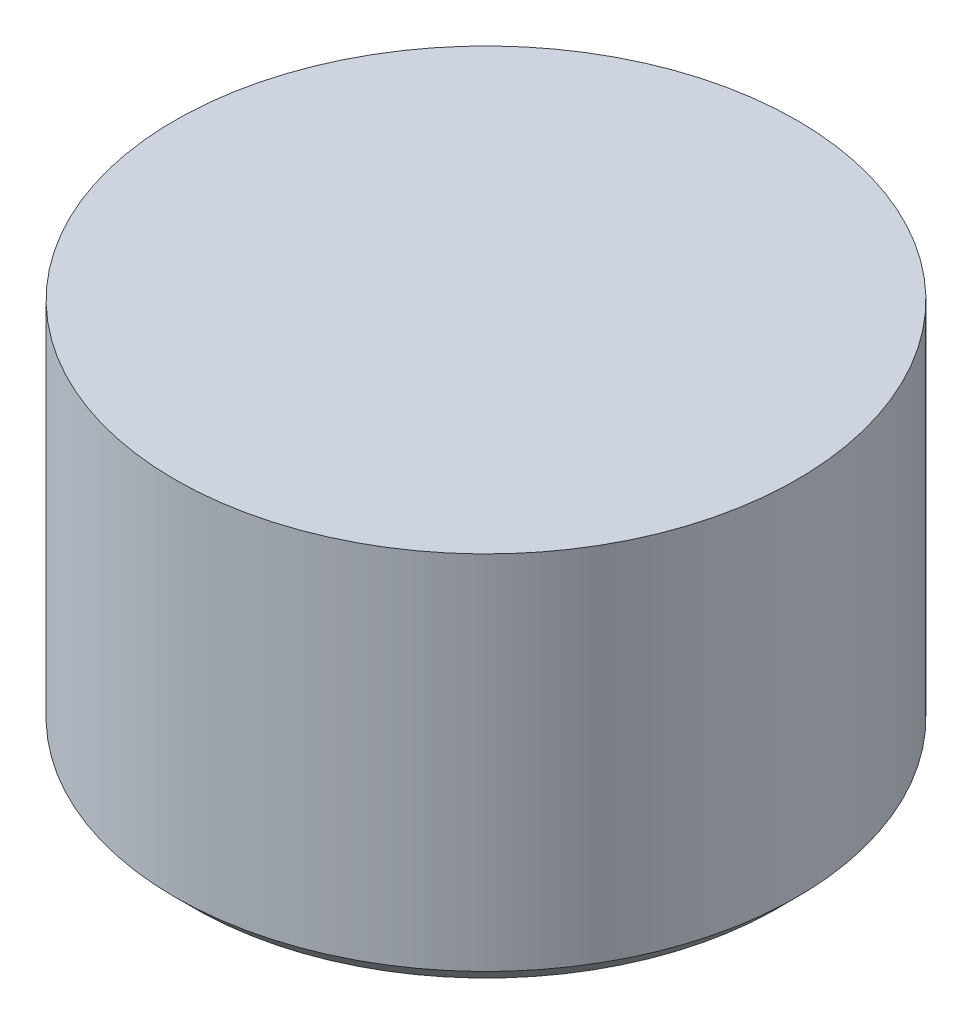
ISO-10303-21;
HEADER;
FILE_DESCRIPTION(('STEP AP214'),'2;1');
FILE_NAME('part.step','',(''),(''),'','','');
FILE_SCHEMA(('AUTOMOTIVE_DESIGN { 1 0 10303 214 1 1 1 1 }'));
ENDSEC;
DATA;
#1=APPLICATION_CONTEXT('core data for automotive mechanical design processes');
#2=APPLICATION_PROTOCOL_DEFINITION('international standard','automotive_design',2000,#1);
#3=PRODUCT_CONTEXT('',#1,'mechanical');
#4=PRODUCT('Part','Part','',(#3));
#5=PRODUCT_RELATED_PRODUCT_CATEGORY('part','',(#4));
#6=PRODUCT_DEFINITION_FORMATION('','',#4);
#7=PRODUCT_DEFINITION_CONTEXT('part definition',#1,'design');
#8=PRODUCT_DEFINITION('design','',#6,#7);
#9=PRODUCT_DEFINITION_SHAPE('','',#8);
#10=(LENGTH_UNIT() NAMED_UNIT(*) SI_UNIT(.MILLI.,.METRE.));
#11=(NAMED_UNIT(*) PLANE_ANGLE_UNIT() SI_UNIT($,.RADIAN.));
#12=(NAMED_UNIT(*) SI_UNIT($,.STERADIAN.) SOLID_ANGLE_UNIT());
#13=UNCERTAINTY_MEASURE_WITH_UNIT(LENGTH_MEASURE(1.E-05),#10,'distance_accuracy_value','');
#14=(GEOMETRIC_REPRESENTATION_CONTEXT(3) GLOBAL_UNCERTAINTY_ASSIGNED_CONTEXT((#13)) GLOBAL_UNIT_ASSIGNED_CONTEXT((#10,
#11,#12)) REPRESENTATION_CONTEXT('',''));
#15=CARTESIAN_POINT('',(0.,0.,0.));
#16=DIRECTION('',(0.,0.,1.));
#17=DIRECTION('',(1.,0.,0.));
#18=AXIS2_PLACEMENT_3D('',#15,#16,#17);
#19=CARTESIAN_POINT('',(-4.92125,-9.238275296126,-7.55));
#20=DIRECTION('',(0.,-1.,0.));
#21=DIRECTION('',(-1.,0.,0.));
#22=AXIS2_PLACEMENT_3D('',#19,#20,#21);
#23=PLANE('',#22);
#24=DIRECTION('',(-0.866025403784439,0.,0.5));
#25=VECTOR('',#24,1.);
#26=CARTESIAN_POINT('',(1.0414,-9.23827529612599,-6.94874742966592));
#27=LINE('',#26,#25);
#28=CARTESIAN_POINT('',(1.0414,-9.23827529612599,-6.94874742966592));
#29=VERTEX_POINT('',#28);
#30=CARTESIAN_POINT('',(0.,-9.238275296126,-6.34749485933185));
#31=VERTEX_POINT('',#30);
#32=EDGE_CURVE('E141',#29,#31,#27,.T.);
#33=ORIENTED_EDGE('',*,*,#32,.T.);
#34=DIRECTION('',(-0.866025403784438,0.,-0.5));
#35=VECTOR('',#34,1.);
#36=CARTESIAN_POINT('',(0.,-9.238275296126,-6.34749485933185));
#37=LINE('',#36,#35);
#38=CARTESIAN_POINT('',(-1.0414,-9.23827529612599,-6.94874742966593));
#39=VERTEX_POINT('',#38);
#40=EDGE_CURVE('E10',#31,#39,#37,.T.);
#41=ORIENTED_EDGE('',*,*,#40,.T.);
#42=DIRECTION('',(0.,0.,-1.));
#43=VECTOR('',#42,1.);
#44=CARTESIAN_POINT('',(-1.0414,-9.23827529612599,-6.94874742966593));
#45=LINE('',#44,#43);
#46=CARTESIAN_POINT('',(-1.0414,-9.238275296126,-8.15125257033408));
#47=VERTEX_POINT('',#46);
#48=EDGE_CURVE('E42',#39,#47,#45,.T.);
#49=ORIENTED_EDGE('',*,*,#48,.T.);
#50=DIRECTION('',(0.866025403784439,0.,-0.5));
#51=VECTOR('',#50,1.);
#52=CARTESIAN_POINT('',(-1.0414,-9.238275296126,-8.15125257033408));
#53=LINE('',#52,#51);
#54=CARTESIAN_POINT('',(0.,-9.238275296126,-8.75250514066815));
#55=VERTEX_POINT('',#54);
#56=EDGE_CURVE('E177',#47,#55,#53,.T.);
#57=ORIENTED_EDGE('',*,*,#56,.T.);
#58=DIRECTION('',(0.866025403784438,0.,0.5));
#59=VECTOR('',#58,1.);
#60=CARTESIAN_POINT('',(0.,-9.238275296126,-8.75250514066815));
#61=LINE('',#60,#59);
#62=CARTESIAN_POINT('',(1.0414,-9.238275296126,-8.15125257033408));
#63=VERTEX_POINT('',#62);
#64=EDGE_CURVE('E171',#55,#63,#61,.T.);
#65=ORIENTED_EDGE('',*,*,#64,.T.);
#66=DIRECTION('',(0.,0.,1.));
#67=VECTOR('',#66,1.);
#68=CARTESIAN_POINT('',(1.0414,-9.238275296126,-8.15125257033408));
#69=LINE('',#68,#67);
#70=EDGE_CURVE('E140',#63,#29,#69,.T.);
#71=ORIENTED_EDGE('',*,*,#70,.T.);
#72=EDGE_LOOP('',(#33,#41,#49,#57,#65,#71));
#73=FACE_BOUND('',#72,.T.);
#74=ADVANCED_FACE('F16',(#73),#23,.T.);
#75=CARTESIAN_POINT('',(0.,-9.238275296126,-6.34749485933185));
#76=DIRECTION('',(-0.5,0.,0.866025403784438));
#77=DIRECTION('',(0.,1.,0.));
#78=AXIS2_PLACEMENT_3D('',#75,#76,#77);
#79=PLANE('',#78);
#80=DIRECTION('',(-0.866025403784438,0.,-0.5));
#81=VECTOR('',#80,1.);
#82=CARTESIAN_POINT('',(0.,-10.203475296126,-6.34749485933185));
#83=LINE('',#82,#81);
#84=CARTESIAN_POINT('',(0.,-10.203475296126,-6.34749485933185));
#85=VERTEX_POINT('',#84);
#86=CARTESIAN_POINT('',(-1.0414,-10.203475296126,-6.94874742966593));
#87=VERTEX_POINT('',#86);
#88=EDGE_CURVE('E148',#85,#87,#83,.T.);
#89=ORIENTED_EDGE('',*,*,#88,.T.);
#90=DIRECTION('',(0.,-1.,0.));
#91=VECTOR('',#90,1.);
#92=CARTESIAN_POINT('',(-1.0414,-9.23827529612599,-6.94874742966593));
#93=LINE('',#92,#91);
#94=EDGE_CURVE('E25',#39,#87,#93,.T.);
#95=ORIENTED_EDGE('',*,*,#94,.F.);
#96=ORIENTED_EDGE('',*,*,#40,.F.);
#97=DIRECTION('',(0.,-1.,0.));
#98=VECTOR('',#97,1.);
#99=CARTESIAN_POINT('',(0.,-9.238275296126,-6.34749485933185));
#100=LINE('',#99,#98);
#101=EDGE_CURVE('E152',#31,#85,#100,.T.);
#102=ORIENTED_EDGE('',*,*,#101,.T.);
#103=EDGE_LOOP('',(#89,#95,#96,#102));
#104=FACE_BOUND('',#103,.T.);
#105=ADVANCED_FACE('F18',(#104),#79,.F.);
#106=CARTESIAN_POINT('',(-1.0414,-9.23827529612599,-6.94874742966593));
#107=DIRECTION('',(-1.,0.,0.));
#108=DIRECTION('',(0.,0.,1.));
#109=AXIS2_PLACEMENT_3D('',#106,#107,#108);
#110=PLANE('',#109);
#111=DIRECTION('',(0.,0.,-1.));
#112=VECTOR('',#111,1.);
#113=CARTESIAN_POINT('',(-1.0414,-10.203475296126,-6.94874742966593));
#114=LINE('',#113,#112);
#115=CARTESIAN_POINT('',(-1.0414,-10.203475296126,-8.15125257033408));
#116=VERTEX_POINT('',#115);
#117=EDGE_CURVE('E132',#87,#116,#114,.T.);
#118=ORIENTED_EDGE('',*,*,#117,.T.);
#119=DIRECTION('',(0.,-1.,0.));
#120=VECTOR('',#119,1.);
#121=CARTESIAN_POINT('',(-1.0414,-9.238275296126,-8.15125257033408));
#122=LINE('',#121,#120);
#123=EDGE_CURVE('E180',#47,#116,#122,.T.);
#124=ORIENTED_EDGE('',*,*,#123,.F.);
#125=ORIENTED_EDGE('',*,*,#48,.F.);
#126=ORIENTED_EDGE('',*,*,#94,.T.);
#127=EDGE_LOOP('',(#118,#124,#125,#126));
#128=FACE_BOUND('',#127,.T.);
#129=ADVANCED_FACE('F188',(#128),#110,.F.);
#130=CARTESIAN_POINT('',(-1.0414,-9.238275296126,-8.15125257033408));
#131=DIRECTION('',(-0.5,0.,-0.866025403784439));
#132=DIRECTION('',(-0.866025403784439,0.,0.5));
#133=AXIS2_PLACEMENT_3D('',#130,#131,#132);
#134=PLANE('',#133);
#135=DIRECTION('',(0.866025403784439,0.,-0.5));
#136=VECTOR('',#135,1.);
#137=CARTESIAN_POINT('',(-1.0414,-10.203475296126,-8.15125257033408));
#138=LINE('',#137,#136);
#139=CARTESIAN_POINT('',(0.,-10.203475296126,-8.75250514066815));
#140=VERTEX_POINT('',#139);
#141=EDGE_CURVE('E129',#116,#140,#138,.T.);
#142=ORIENTED_EDGE('',*,*,#141,.T.);
#143=DIRECTION('',(0.,-1.,0.));
#144=VECTOR('',#143,1.);
#145=CARTESIAN_POINT('',(0.,-9.238275296126,-8.75250514066815));
#146=LINE('',#145,#144);
#147=EDGE_CURVE('E174',#55,#140,#146,.T.);
#148=ORIENTED_EDGE('',*,*,#147,.F.);
#149=ORIENTED_EDGE('',*,*,#56,.F.);
#150=ORIENTED_EDGE('',*,*,#123,.T.);
#151=EDGE_LOOP('',(#142,#148,#149,#150));
#152=FACE_BOUND('',#151,.T.);
#153=ADVANCED_FACE('F202',(#152),#134,.F.);
#154=CARTESIAN_POINT('',(0.,-9.238275296126,-8.75250514066815));
#155=DIRECTION('',(0.5,0.,-0.866025403784438));
#156=DIRECTION('',(0.,-1.,0.));
#157=AXIS2_PLACEMENT_3D('',#154,#155,#156);
#158=PLANE('',#157);
#159=DIRECTION('',(0.866025403784438,0.,0.5));
#160=VECTOR('',#159,1.);
#161=CARTESIAN_POINT('',(0.,-10.203475296126,-8.75250514066815));
#162=LINE('',#161,#160);
#163=CARTESIAN_POINT('',(1.0414,-10.203475296126,-8.15125257033408));
#164=VERTEX_POINT('',#163);
#165=EDGE_CURVE('E133',#140,#164,#162,.T.);
#166=ORIENTED_EDGE('',*,*,#165,.T.);
#167=DIRECTION('',(0.,-1.,0.));
#168=VECTOR('',#167,1.);
#169=CARTESIAN_POINT('',(1.0414,-9.238275296126,-8.15125257033408));
#170=LINE('',#169,#168);
#171=EDGE_CURVE('E168',#63,#164,#170,.T.);
#172=ORIENTED_EDGE('',*,*,#171,.F.);
#173=ORIENTED_EDGE('',*,*,#64,.F.);
#174=ORIENTED_EDGE('',*,*,#147,.T.);
#175=EDGE_LOOP('',(#166,#172,#173,#174));
#176=FACE_BOUND('',#175,.T.);
#177=ADVANCED_FACE('F209',(#176),#158,.F.);
#178=CARTESIAN_POINT('',(1.0414,-9.238275296126,-8.15125257033408));
#179=DIRECTION('',(1.,0.,0.));
#180=DIRECTION('',(0.,0.,1.));
#181=AXIS2_PLACEMENT_3D('',#178,#179,#180);
#182=PLANE('',#181);
#183=DIRECTION('',(0.,0.,1.));
#184=VECTOR('',#183,1.);
#185=CARTESIAN_POINT('',(1.0414,-10.203475296126,-8.15125257033408));
#186=LINE('',#185,#184);
#187=CARTESIAN_POINT('',(1.0414,-10.203475296126,-6.94874742966592));
#188=VERTEX_POINT('',#187);
#189=EDGE_CURVE('E142',#164,#188,#186,.T.);
#190=ORIENTED_EDGE('',*,*,#189,.T.);
#191=DIRECTION('',(0.,-1.,0.));
#192=VECTOR('',#191,1.);
#193=CARTESIAN_POINT('',(1.0414,-9.23827529612599,-6.94874742966592));
#194=LINE('',#193,#192);
#195=EDGE_CURVE('E137',#29,#188,#194,.T.);
#196=ORIENTED_EDGE('',*,*,#195,.F.);
#197=ORIENTED_EDGE('',*,*,#70,.F.);
#198=ORIENTED_EDGE('',*,*,#171,.T.);
#199=EDGE_LOOP('',(#190,#196,#197,#198));
#200=FACE_BOUND('',#199,.T.);
#201=ADVANCED_FACE('F211',(#200),#182,.F.);
#202=CARTESIAN_POINT('',(1.0414,-9.23827529612599,-6.94874742966592));
#203=DIRECTION('',(0.5,0.,0.866025403784439));
#204=DIRECTION('',(0.,-1.,0.));
#205=AXIS2_PLACEMENT_3D('',#202,#203,#204);
#206=PLANE('',#205);
#207=DIRECTION('',(-0.866025403784439,0.,0.5));
#208=VECTOR('',#207,1.);
#209=CARTESIAN_POINT('',(1.0414,-10.203475296126,-6.94874742966592));
#210=LINE('',#209,#208);
#211=EDGE_CURVE('E128',#188,#85,#210,.T.);
#212=ORIENTED_EDGE('',*,*,#211,.T.);
#213=ORIENTED_EDGE('',*,*,#101,.F.);
#214=ORIENTED_EDGE('',*,*,#32,.F.);
#215=ORIENTED_EDGE('',*,*,#195,.T.);
#216=EDGE_LOOP('',(#212,#213,#214,#215));
#217=FACE_BOUND('',#216,.T.);
#218=ADVANCED_FACE('F214',(#217),#206,.F.);
#219=CARTESIAN_POINT('',(0.,-10.203475296126,-7.55));
#220=DIRECTION('',(0.,-1.,0.));
#221=DIRECTION('',(-1.,0.,0.));
#222=AXIS2_PLACEMENT_3D('',#219,#220,#221);
#223=PLANE('',#222);
#224=ORIENTED_EDGE('',*,*,#211,.F.);
#225=ORIENTED_EDGE('',*,*,#189,.F.);
#226=ORIENTED_EDGE('',*,*,#165,.F.);
#227=ORIENTED_EDGE('',*,*,#141,.F.);
#228=ORIENTED_EDGE('',*,*,#117,.F.);
#229=ORIENTED_EDGE('',*,*,#88,.F.);
#230=EDGE_LOOP('',(#224,#225,#226,#227,#228,#229));
#231=FACE_BOUND('',#230,.T.);
#232=CARTESIAN_POINT('',(0.,-10.203475296126,-7.55));
#233=DIRECTION('',(0.,-1.,0.));
#234=DIRECTION('',(0.,0.,-1.));
#235=AXIS2_PLACEMENT_3D('',#232,#233,#234);
#236=CIRCLE('',#235,1.905);
#237=CARTESIAN_POINT('',(0.,-10.203475296126,-9.455));
#238=VERTEX_POINT('',#237);
#239=EDGE_CURVE('E109',#238,#238,#236,.T.);
#240=ORIENTED_EDGE('',*,*,#239,.T.);
#241=EDGE_LOOP('',(#240));
#242=FACE_BOUND('',#241,.T.);
#243=ADVANCED_FACE('F196',(#231,#242),#223,.T.);
#244=CARTESIAN_POINT('',(0.,-7.714275296126,-7.55));
#245=DIRECTION('',(0.,-1.,0.));
#246=DIRECTION('',(-1.,0.,0.));
#247=AXIS2_PLACEMENT_3D('',#244,#245,#246);
#248=PLANE('',#247);
#249=CARTESIAN_POINT('',(0.,-7.714275296126,-7.55));
#250=DIRECTION('',(0.,-1.,0.));
#251=DIRECTION('',(0.,0.,-1.));
#252=AXIS2_PLACEMENT_3D('',#249,#250,#251);
#253=CIRCLE('',#252,2.032);
#254=CARTESIAN_POINT('',(0.,-7.714275296126,-5.518));
#255=VERTEX_POINT('',#254);
#256=EDGE_CURVE('E107',#255,#255,#253,.T.);
#257=ORIENTED_EDGE('',*,*,#256,.F.);
#258=EDGE_LOOP('',(#257));
#259=FACE_BOUND('',#258,.T.);
#260=ADVANCED_FACE('F222',(#259),#248,.F.);
#261=CARTESIAN_POINT('',(0.,-7.714275296126,-7.55));
#262=DIRECTION('',(0.,-1.,0.));
#263=DIRECTION('',(0.,0.,-1.));
#264=AXIS2_PLACEMENT_3D('',#261,#262,#263);
#265=CYLINDRICAL_SURFACE('',#264,2.032);
#266=CARTESIAN_POINT('',(0.,-10.076475296126,-7.55));
#267=DIRECTION('',(0.,1.,0.));
#268=DIRECTION('',(0.,0.,-1.));
#269=AXIS2_PLACEMENT_3D('',#266,#267,#268);
#270=CIRCLE('',#269,2.032);
#271=CARTESIAN_POINT('',(0.,-10.076475296126,-5.518));
#272=VERTEX_POINT('',#271);
#273=CARTESIAN_POINT('',(0.,-10.076475296126,-9.582));
#274=VERTEX_POINT('',#273);
#275=EDGE_CURVE('E105',#272,#274,#270,.T.);
#276=ORIENTED_EDGE('',*,*,#275,.T.);
#277=CARTESIAN_POINT('',(0.,-10.076475296126,-7.55));
#278=DIRECTION('',(0.,1.,0.));
#279=DIRECTION('',(0.,0.,-1.));
#280=AXIS2_PLACEMENT_3D('',#277,#278,#279);
#281=CIRCLE('',#280,2.032);
#282=EDGE_CURVE('E112',#274,#272,#281,.T.);
#283=ORIENTED_EDGE('',*,*,#282,.T.);
#284=DIRECTION('',(0.,1.,0.));
#285=VECTOR('',#284,1.);
#286=CARTESIAN_POINT('',(0.,-7.714275296126,-5.518));
#287=LINE('',#286,#285);
#288=EDGE_CURVE('E101',#272,#255,#287,.T.);
#289=ORIENTED_EDGE('',*,*,#288,.T.);
#290=ORIENTED_EDGE('',*,*,#256,.T.);
#291=ORIENTED_EDGE('',*,*,#288,.F.);
#292=EDGE_LOOP('',(#276,#283,#289,#290,#291));
#293=FACE_BOUND('',#292,.T.);
#294=ADVANCED_FACE('F103',(#293),#265,.T.);
#295=CARTESIAN_POINT('',(0.,-10.203475296126,-7.55));
#296=DIRECTION('',(0.,1.,0.));
#297=DIRECTION('',(0.,0.,1.));
#298=AXIS2_PLACEMENT_3D('',#295,#296,#297);
#299=CONICAL_SURFACE('',#298,1.905,0.785398163397447);
#300=ORIENTED_EDGE('',*,*,#275,.F.);
#301=ORIENTED_EDGE('',*,*,#282,.F.);
#302=DIRECTION('',(0.,-0.707106781186549,0.707106781186546));
#303=VECTOR('',#302,1.);
#304=CARTESIAN_POINT('',(0.,-10.203475296126,-9.455));
#305=LINE('',#304,#303);
#306=EDGE_CURVE('E116',#274,#238,#305,.T.);
#307=ORIENTED_EDGE('',*,*,#306,.T.);
#308=ORIENTED_EDGE('',*,*,#239,.F.);
#309=ORIENTED_EDGE('',*,*,#306,.F.);
#310=EDGE_LOOP('',(#300,#301,#307,#308,#309));
#311=FACE_BOUND('',#310,.T.);
#312=ADVANCED_FACE('F118',(#311),#299,.T.);
#313=CLOSED_SHELL('',(#74,#105,#129,#153,#177,#201,#218,#243,#260,#294,#312));
#314=MANIFOLD_SOLID_BREP('B1',#313);
#315=ADVANCED_BREP_SHAPE_REPRESENTATION('',(#18,#314),#14);
#316=SHAPE_DEFINITION_REPRESENTATION(#9,#315);
ENDSEC;
END-ISO-10303-21;
